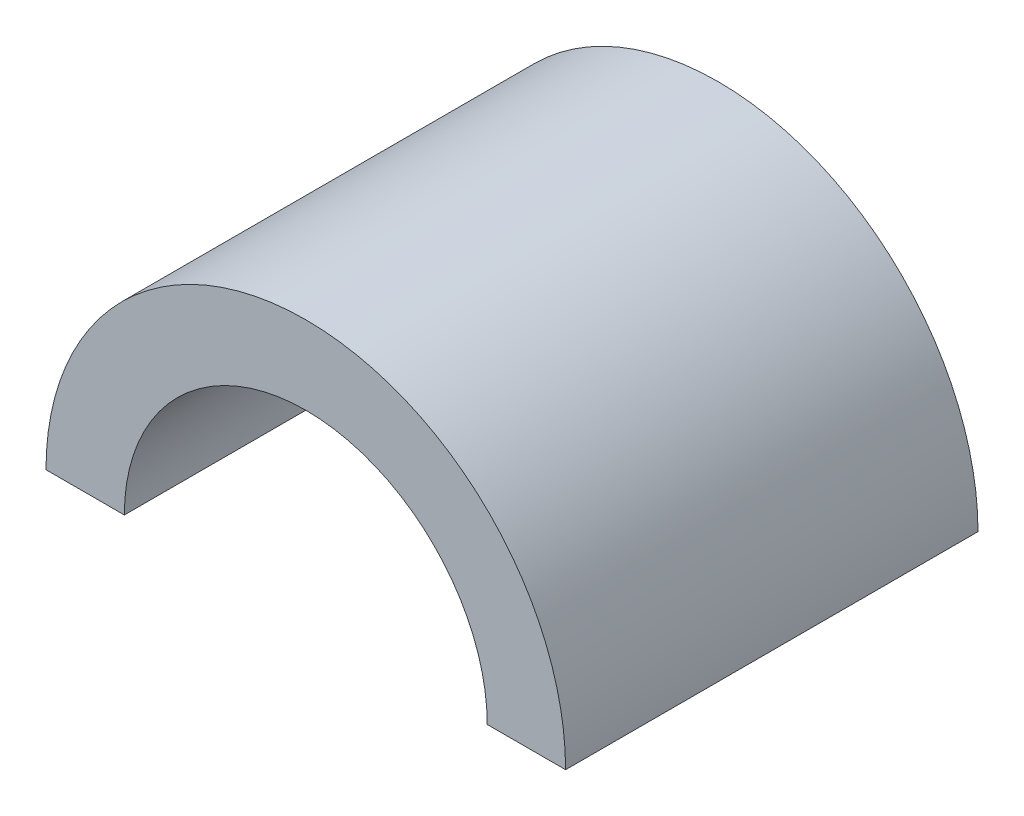
ISO-10303-21;
HEADER;
FILE_DESCRIPTION(('STEP AP214'),'2;1');
FILE_NAME('part.step','',(''),(''),'','','');
FILE_SCHEMA(('AUTOMOTIVE_DESIGN { 1 0 10303 214 1 1 1 1 }'));
ENDSEC;
DATA;
#1=APPLICATION_CONTEXT('core data for automotive mechanical design processes');
#2=APPLICATION_PROTOCOL_DEFINITION('international standard','automotive_design',2000,#1);
#3=PRODUCT_CONTEXT('',#1,'mechanical');
#4=PRODUCT('Part','Part','',(#3));
#5=PRODUCT_RELATED_PRODUCT_CATEGORY('part','',(#4));
#6=PRODUCT_DEFINITION_FORMATION('','',#4);
#7=PRODUCT_DEFINITION_CONTEXT('part definition',#1,'design');
#8=PRODUCT_DEFINITION('design','',#6,#7);
#9=PRODUCT_DEFINITION_SHAPE('','',#8);
#10=(LENGTH_UNIT() NAMED_UNIT(*) SI_UNIT(.MILLI.,.METRE.));
#11=(NAMED_UNIT(*) PLANE_ANGLE_UNIT() SI_UNIT($,.RADIAN.));
#12=(NAMED_UNIT(*) SI_UNIT($,.STERADIAN.) SOLID_ANGLE_UNIT());
#13=UNCERTAINTY_MEASURE_WITH_UNIT(LENGTH_MEASURE(1.E-05),#10,'distance_accuracy_value','');
#14=(GEOMETRIC_REPRESENTATION_CONTEXT(3) GLOBAL_UNCERTAINTY_ASSIGNED_CONTEXT((#13)) GLOBAL_UNIT_ASSIGNED_CONTEXT((#10,
#11,#12)) REPRESENTATION_CONTEXT('',''));
#15=CARTESIAN_POINT('',(0.,0.,0.));
#16=DIRECTION('',(0.,0.,1.));
#17=DIRECTION('',(1.,0.,0.));
#18=AXIS2_PLACEMENT_3D('',#15,#16,#17);
#19=CARTESIAN_POINT('',(0.,0.,25.4));
#20=DIRECTION('',(0.,0.,-1.));
#21=DIRECTION('',(-1.,0.,0.));
#22=AXIS2_PLACEMENT_3D('',#19,#20,#21);
#23=CYLINDRICAL_SURFACE('',#22,16.002);
#24=CARTESIAN_POINT('',(0.,0.,0.));
#25=DIRECTION('',(0.,0.,1.));
#26=DIRECTION('',(1.,0.,0.));
#27=AXIS2_PLACEMENT_3D('',#24,#25,#26);
#28=CIRCLE('',#27,16.002);
#29=CARTESIAN_POINT('',(16.002,0.,0.));
#30=VERTEX_POINT('',#29);
#31=CARTESIAN_POINT('',(-16.002,0.,0.));
#32=VERTEX_POINT('',#31);
#33=EDGE_CURVE('E104',#30,#32,#28,.T.);
#34=ORIENTED_EDGE('',*,*,#33,.T.);
#35=DIRECTION('',(0.,0.,-1.));
#36=VECTOR('',#35,1.);
#37=CARTESIAN_POINT('',(-16.002,0.,25.4));
#38=LINE('',#37,#36);
#39=CARTESIAN_POINT('',(-16.002,0.,25.4));
#40=VERTEX_POINT('',#39);
#41=EDGE_CURVE('E11',#40,#32,#38,.T.);
#42=ORIENTED_EDGE('',*,*,#41,.F.);
#43=CARTESIAN_POINT('',(0.,0.,25.4));
#44=DIRECTION('',(0.,0.,1.));
#45=DIRECTION('',(1.,0.,0.));
#46=AXIS2_PLACEMENT_3D('',#43,#44,#45);
#47=CIRCLE('',#46,16.002);
#48=CARTESIAN_POINT('',(16.002,0.,25.4));
#49=VERTEX_POINT('',#48);
#50=EDGE_CURVE('E92',#49,#40,#47,.T.);
#51=ORIENTED_EDGE('',*,*,#50,.F.);
#52=DIRECTION('',(0.,0.,-1.));
#53=VECTOR('',#52,1.);
#54=CARTESIAN_POINT('',(16.002,0.,25.4));
#55=LINE('',#54,#53);
#56=EDGE_CURVE('E100',#49,#30,#55,.T.);
#57=ORIENTED_EDGE('',*,*,#56,.T.);
#58=EDGE_LOOP('',(#34,#42,#51,#57));
#59=FACE_BOUND('',#58,.T.);
#60=ADVANCED_FACE('F41',(#59),#23,.T.);
#61=CARTESIAN_POINT('',(-16.002,0.,25.4));
#62=DIRECTION('',(0.,1.,0.));
#63=DIRECTION('',(0.,0.,1.));
#64=AXIS2_PLACEMENT_3D('',#61,#62,#63);
#65=PLANE('',#64);
#66=DIRECTION('',(1.,0.,0.));
#67=VECTOR('',#66,1.);
#68=CARTESIAN_POINT('',(-16.002,0.,0.));
#69=LINE('',#68,#67);
#70=CARTESIAN_POINT('',(-11.176,0.,0.));
#71=VERTEX_POINT('',#70);
#72=EDGE_CURVE('E96',#32,#71,#69,.T.);
#73=ORIENTED_EDGE('',*,*,#72,.T.);
#74=DIRECTION('',(0.,0.,-1.));
#75=VECTOR('',#74,1.);
#76=CARTESIAN_POINT('',(-11.176,0.,25.4));
#77=LINE('',#76,#75);
#78=CARTESIAN_POINT('',(-11.176,0.,25.4));
#79=VERTEX_POINT('',#78);
#80=EDGE_CURVE('E49',#79,#71,#77,.T.);
#81=ORIENTED_EDGE('',*,*,#80,.F.);
#82=DIRECTION('',(1.,0.,0.));
#83=VECTOR('',#82,1.);
#84=CARTESIAN_POINT('',(-16.002,0.,25.4));
#85=LINE('',#84,#83);
#86=EDGE_CURVE('E87',#40,#79,#85,.T.);
#87=ORIENTED_EDGE('',*,*,#86,.F.);
#88=ORIENTED_EDGE('',*,*,#41,.T.);
#89=EDGE_LOOP('',(#73,#81,#87,#88));
#90=FACE_BOUND('',#89,.T.);
#91=ADVANCED_FACE('F95',(#90),#65,.F.);
#92=CARTESIAN_POINT('',(0.,0.,25.4));
#93=DIRECTION('',(0.,0.,-1.));
#94=DIRECTION('',(-1.,0.,0.));
#95=AXIS2_PLACEMENT_3D('',#92,#93,#94);
#96=CYLINDRICAL_SURFACE('',#95,11.176);
#97=CARTESIAN_POINT('',(0.,0.,0.));
#98=DIRECTION('',(0.,0.,-1.));
#99=DIRECTION('',(1.,0.,0.));
#100=AXIS2_PLACEMENT_3D('',#97,#98,#99);
#101=CIRCLE('',#100,11.176);
#102=CARTESIAN_POINT('',(11.176,0.,0.));
#103=VERTEX_POINT('',#102);
#104=EDGE_CURVE('E74',#71,#103,#101,.T.);
#105=ORIENTED_EDGE('',*,*,#104,.T.);
#106=DIRECTION('',(0.,0.,-1.));
#107=VECTOR('',#106,1.);
#108=CARTESIAN_POINT('',(11.176,0.,25.4));
#109=LINE('',#108,#107);
#110=CARTESIAN_POINT('',(11.176,0.,25.4));
#111=VERTEX_POINT('',#110);
#112=EDGE_CURVE('E97',#111,#103,#109,.T.);
#113=ORIENTED_EDGE('',*,*,#112,.F.);
#114=CARTESIAN_POINT('',(0.,0.,25.4));
#115=DIRECTION('',(0.,0.,-1.));
#116=DIRECTION('',(1.,0.,0.));
#117=AXIS2_PLACEMENT_3D('',#114,#115,#116);
#118=CIRCLE('',#117,11.176);
#119=EDGE_CURVE('E90',#79,#111,#118,.T.);
#120=ORIENTED_EDGE('',*,*,#119,.F.);
#121=ORIENTED_EDGE('',*,*,#80,.T.);
#122=EDGE_LOOP('',(#105,#113,#120,#121));
#123=FACE_BOUND('',#122,.T.);
#124=ADVANCED_FACE('F98',(#123),#96,.F.);
#125=CARTESIAN_POINT('',(11.176,0.,25.4));
#126=DIRECTION('',(0.,1.,0.));
#127=DIRECTION('',(0.,0.,1.));
#128=AXIS2_PLACEMENT_3D('',#125,#126,#127);
#129=PLANE('',#128);
#130=DIRECTION('',(1.,0.,0.));
#131=VECTOR('',#130,1.);
#132=CARTESIAN_POINT('',(11.176,0.,0.));
#133=LINE('',#132,#131);
#134=EDGE_CURVE('E80',#103,#30,#133,.T.);
#135=ORIENTED_EDGE('',*,*,#134,.T.);
#136=ORIENTED_EDGE('',*,*,#56,.F.);
#137=DIRECTION('',(1.,0.,0.));
#138=VECTOR('',#137,1.);
#139=CARTESIAN_POINT('',(11.176,0.,25.4));
#140=LINE('',#139,#138);
#141=EDGE_CURVE('E57',#111,#49,#140,.T.);
#142=ORIENTED_EDGE('',*,*,#141,.F.);
#143=ORIENTED_EDGE('',*,*,#112,.T.);
#144=EDGE_LOOP('',(#135,#136,#142,#143));
#145=FACE_BOUND('',#144,.T.);
#146=ADVANCED_FACE('F111',(#145),#129,.F.);
#147=CARTESIAN_POINT('',(0.,0.,25.4));
#148=DIRECTION('',(0.,0.,1.));
#149=DIRECTION('',(1.,0.,0.));
#150=AXIS2_PLACEMENT_3D('',#147,#148,#149);
#151=PLANE('',#150);
#152=ORIENTED_EDGE('',*,*,#50,.T.);
#153=ORIENTED_EDGE('',*,*,#86,.T.);
#154=ORIENTED_EDGE('',*,*,#119,.T.);
#155=ORIENTED_EDGE('',*,*,#141,.T.);
#156=EDGE_LOOP('',(#152,#153,#154,#155));
#157=FACE_BOUND('',#156,.T.);
#158=ADVANCED_FACE('F88',(#157),#151,.T.);
#159=CARTESIAN_POINT('',(0.,0.,0.));
#160=DIRECTION('',(0.,0.,1.));
#161=DIRECTION('',(1.,0.,0.));
#162=AXIS2_PLACEMENT_3D('',#159,#160,#161);
#163=PLANE('',#162);
#164=ORIENTED_EDGE('',*,*,#33,.F.);
#165=ORIENTED_EDGE('',*,*,#134,.F.);
#166=ORIENTED_EDGE('',*,*,#104,.F.);
#167=ORIENTED_EDGE('',*,*,#72,.F.);
#168=EDGE_LOOP('',(#164,#165,#166,#167));
#169=FACE_BOUND('',#168,.T.);
#170=ADVANCED_FACE('F114',(#169),#163,.F.);
#171=CLOSED_SHELL('',(#60,#91,#124,#146,#158,#170));
#172=MANIFOLD_SOLID_BREP('B2',#171);
#173=ADVANCED_BREP_SHAPE_REPRESENTATION('',(#18,#172),#14);
#174=SHAPE_DEFINITION_REPRESENTATION(#9,#173);
ENDSEC;
END-ISO-10303-21;
